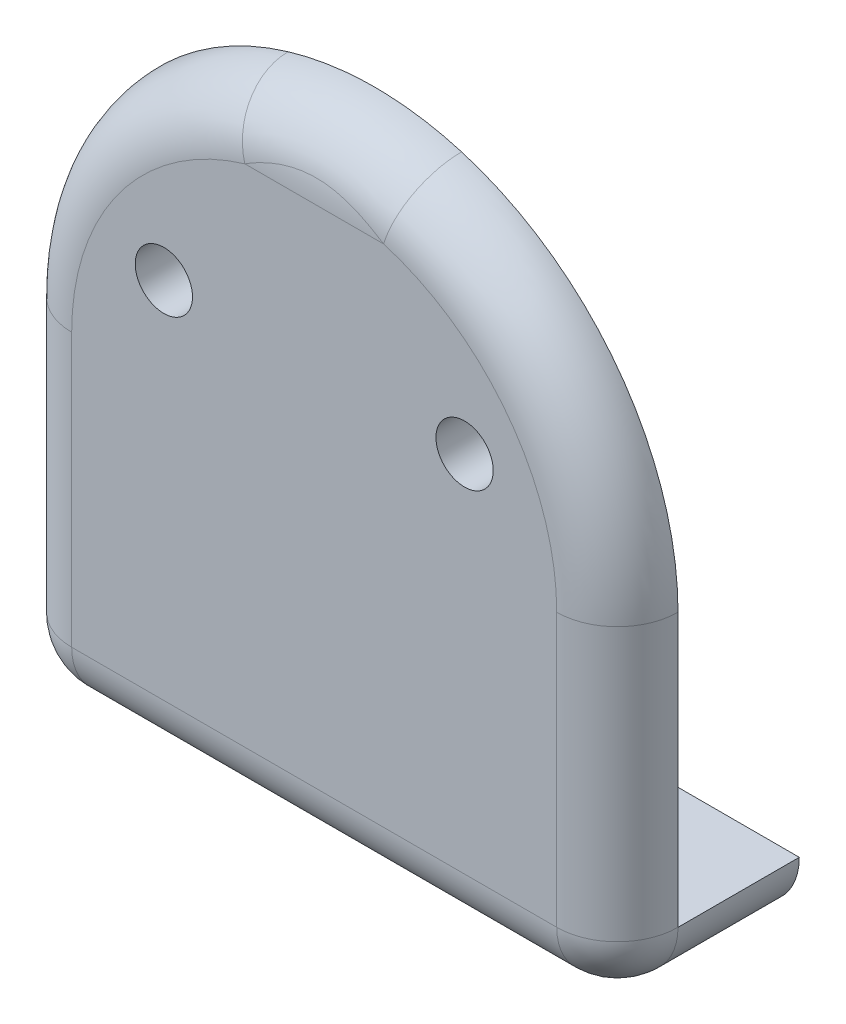
ISO-10303-21;
HEADER;
FILE_DESCRIPTION(('STEP AP214'),'2;1');
FILE_NAME('part.step','',(''),(''),'','','');
FILE_SCHEMA(('AUTOMOTIVE_DESIGN { 1 0 10303 214 1 1 1 1 }'));
ENDSEC;
DATA;
#1=APPLICATION_CONTEXT('core data for automotive mechanical design processes');
#2=APPLICATION_PROTOCOL_DEFINITION('international standard','automotive_design',2000,#1);
#3=PRODUCT_CONTEXT('',#1,'mechanical');
#4=PRODUCT('Part','Part','',(#3));
#5=PRODUCT_RELATED_PRODUCT_CATEGORY('part','',(#4));
#6=PRODUCT_DEFINITION_FORMATION('','',#4);
#7=PRODUCT_DEFINITION_CONTEXT('part definition',#1,'design');
#8=PRODUCT_DEFINITION('design','',#6,#7);
#9=PRODUCT_DEFINITION_SHAPE('','',#8);
#10=(LENGTH_UNIT() NAMED_UNIT(*) SI_UNIT(.MILLI.,.METRE.));
#11=(NAMED_UNIT(*) PLANE_ANGLE_UNIT() SI_UNIT($,.RADIAN.));
#12=(NAMED_UNIT(*) SI_UNIT($,.STERADIAN.) SOLID_ANGLE_UNIT());
#13=UNCERTAINTY_MEASURE_WITH_UNIT(LENGTH_MEASURE(1.E-05),#10,'distance_accuracy_value','');
#14=(GEOMETRIC_REPRESENTATION_CONTEXT(3) GLOBAL_UNCERTAINTY_ASSIGNED_CONTEXT((#13)) GLOBAL_UNIT_ASSIGNED_CONTEXT((#10,
#11,#12)) REPRESENTATION_CONTEXT('',''));
#15=CARTESIAN_POINT('',(0.,0.,0.));
#16=DIRECTION('',(0.,0.,1.));
#17=DIRECTION('',(1.,0.,0.));
#18=AXIS2_PLACEMENT_3D('',#15,#16,#17);
#19=CARTESIAN_POINT('',(31.75,-3.175,3.175));
#20=DIRECTION('',(0.,1.,0.));
#21=DIRECTION('',(0.,0.,1.));
#22=AXIS2_PLACEMENT_3D('',#19,#20,#21);
#23=PLANE('',#22);
#24=DIRECTION('',(0.,0.,-1.));
#25=VECTOR('',#24,1.);
#26=CARTESIAN_POINT('',(3.175,-3.175,3.175));
#27=LINE('',#26,#25);
#28=CARTESIAN_POINT('',(3.175,-3.175,0.));
#29=VERTEX_POINT('',#28);
#30=CARTESIAN_POINT('',(3.175,-3.175,-6.35));
#31=VERTEX_POINT('',#30);
#32=EDGE_CURVE('E127',#29,#31,#27,.T.);
#33=ORIENTED_EDGE('',*,*,#32,.T.);
#34=DIRECTION('',(-1.,0.,0.));
#35=VECTOR('',#34,1.);
#36=CARTESIAN_POINT('',(0.,-3.175,-6.35));
#37=LINE('',#36,#35);
#38=CARTESIAN_POINT('',(28.575,-3.175,-6.35));
#39=VERTEX_POINT('',#38);
#40=EDGE_CURVE('E57',#39,#31,#37,.T.);
#41=ORIENTED_EDGE('',*,*,#40,.F.);
#42=DIRECTION('',(0.,0.,-1.));
#43=VECTOR('',#42,1.);
#44=CARTESIAN_POINT('',(28.575,-3.175,0.));
#45=LINE('',#44,#43);
#46=CARTESIAN_POINT('',(28.575,-3.175,0.));
#47=VERTEX_POINT('',#46);
#48=EDGE_CURVE('E124',#39,#47,#45,.F.);
#49=ORIENTED_EDGE('',*,*,#48,.T.);
#50=DIRECTION('',(-1.,0.,0.));
#51=VECTOR('',#50,1.);
#52=CARTESIAN_POINT('',(31.75,-3.175,0.));
#53=LINE('',#52,#51);
#54=EDGE_CURVE('E311',#47,#29,#53,.T.);
#55=ORIENTED_EDGE('',*,*,#54,.T.);
#56=EDGE_LOOP('',(#33,#41,#49,#55));
#57=FACE_BOUND('',#56,.T.);
#58=ADVANCED_FACE('F42',(#57),#23,.F.);
#59=CARTESIAN_POINT('',(31.75,0.,-31.75));
#60=DIRECTION('',(0.,-1.,0.));
#61=DIRECTION('',(0.,0.,-1.));
#62=AXIS2_PLACEMENT_3D('',#59,#60,#61);
#63=PLANE('',#62);
#64=DIRECTION('',(0.,0.,1.));
#65=VECTOR('',#64,1.);
#66=CARTESIAN_POINT('',(31.75,0.,-31.75));
#67=LINE('',#66,#65);
#68=CARTESIAN_POINT('',(31.75,0.,-6.35));
#69=VERTEX_POINT('',#68);
#70=CARTESIAN_POINT('',(31.75,0.,0.));
#71=VERTEX_POINT('',#70);
#72=EDGE_CURVE('E290',#69,#71,#67,.T.);
#73=ORIENTED_EDGE('',*,*,#72,.F.);
#74=DIRECTION('',(-1.,0.,0.));
#75=VECTOR('',#74,1.);
#76=CARTESIAN_POINT('',(31.75,0.,-6.35));
#77=LINE('',#76,#75);
#78=CARTESIAN_POINT('',(0.,0.,-6.35));
#79=VERTEX_POINT('',#78);
#80=EDGE_CURVE('E114',#69,#79,#77,.T.);
#81=ORIENTED_EDGE('',*,*,#80,.T.);
#82=DIRECTION('',(0.,0.,1.));
#83=VECTOR('',#82,1.);
#84=CARTESIAN_POINT('',(0.,0.,-31.75));
#85=LINE('',#84,#83);
#86=CARTESIAN_POINT('',(0.,0.,0.));
#87=VERTEX_POINT('',#86);
#88=EDGE_CURVE('E298',#79,#87,#85,.T.);
#89=ORIENTED_EDGE('',*,*,#88,.T.);
#90=DIRECTION('',(-1.,0.,0.));
#91=VECTOR('',#90,1.);
#92=CARTESIAN_POINT('',(31.75,0.,0.));
#93=LINE('',#92,#91);
#94=EDGE_CURVE('E297',#71,#87,#93,.T.);
#95=ORIENTED_EDGE('',*,*,#94,.F.);
#96=EDGE_LOOP('',(#73,#81,#89,#95));
#97=FACE_BOUND('',#96,.T.);
#98=ADVANCED_FACE('F190',(#97),#63,.F.);
#99=CARTESIAN_POINT('',(31.75,31.75,3.175));
#100=DIRECTION('',(0.,0.,-1.));
#101=DIRECTION('',(0.,1.,0.));
#102=AXIS2_PLACEMENT_3D('',#99,#100,#101);
#103=PLANE('',#102);
#104=CARTESIAN_POINT('',(23.749,19.05,3.175));
#105=DIRECTION('',(0.,0.,1.));
#106=DIRECTION('',(1.,0.,0.));
#107=AXIS2_PLACEMENT_3D('',#104,#105,#106);
#108=CIRCLE('',#107,1.5);
#109=CARTESIAN_POINT('',(25.249,19.05,3.175));
#110=VERTEX_POINT('',#109);
#111=EDGE_CURVE('E274',#110,#110,#108,.T.);
#112=ORIENTED_EDGE('',*,*,#111,.F.);
#113=EDGE_LOOP('',(#112));
#114=FACE_BOUND('',#113,.T.);
#115=CARTESIAN_POINT('',(8.001,19.05,3.175));
#116=DIRECTION('',(0.,0.,1.));
#117=DIRECTION('',(1.,0.,0.));
#118=AXIS2_PLACEMENT_3D('',#115,#116,#117);
#119=CIRCLE('',#118,1.5);
#120=CARTESIAN_POINT('',(9.501,19.05,3.175));
#121=VERTEX_POINT('',#120);
#122=EDGE_CURVE('E277',#121,#121,#119,.T.);
#123=ORIENTED_EDGE('',*,*,#122,.F.);
#124=EDGE_LOOP('',(#123));
#125=FACE_BOUND('',#124,.T.);
#126=CARTESIAN_POINT('',(15.875,14.2875,3.175));
#127=DIRECTION('',(0.,0.,-1.));
#128=DIRECTION('',(0.,1.,0.));
#129=AXIS2_PLACEMENT_3D('',#126,#127,#128);
#130=CIRCLE('',#129,12.7);
#131=CARTESIAN_POINT('',(12.2416301794497,26.4566669290512,3.175));
#132=VERTEX_POINT('',#131);
#133=CARTESIAN_POINT('',(3.17500000000001,14.2875,3.175));
#134=VERTEX_POINT('',#133);
#135=EDGE_CURVE('E153',#132,#134,#130,.F.);
#136=ORIENTED_EDGE('',*,*,#135,.T.);
#137=DIRECTION('',(0.,-1.,0.));
#138=VECTOR('',#137,1.);
#139=CARTESIAN_POINT('',(3.175,31.75,3.175));
#140=LINE('',#139,#138);
#141=CARTESIAN_POINT('',(3.175,0.,3.175));
#142=VERTEX_POINT('',#141);
#143=EDGE_CURVE('E156',#134,#142,#140,.T.);
#144=ORIENTED_EDGE('',*,*,#143,.T.);
#145=DIRECTION('',(-1.,0.,0.));
#146=VECTOR('',#145,1.);
#147=CARTESIAN_POINT('',(31.75,0.,3.175));
#148=LINE('',#147,#146);
#149=CARTESIAN_POINT('',(28.575,0.,3.175));
#150=VERTEX_POINT('',#149);
#151=EDGE_CURVE('E141',#142,#150,#148,.F.);
#152=ORIENTED_EDGE('',*,*,#151,.T.);
#153=DIRECTION('',(0.,-1.,0.));
#154=VECTOR('',#153,1.);
#155=CARTESIAN_POINT('',(28.575,14.2875,3.175));
#156=LINE('',#155,#154);
#157=CARTESIAN_POINT('',(28.575,14.2875,3.175));
#158=VERTEX_POINT('',#157);
#159=EDGE_CURVE('E147',#150,#158,#156,.F.);
#160=ORIENTED_EDGE('',*,*,#159,.T.);
#161=CARTESIAN_POINT('',(15.875,14.2875,3.175));
#162=DIRECTION('',(0.,0.,-1.));
#163=DIRECTION('',(0.,1.,0.));
#164=AXIS2_PLACEMENT_3D('',#161,#162,#163);
#165=CIRCLE('',#164,12.7);
#166=CARTESIAN_POINT('',(19.5083698205503,26.4566669290512,3.175));
#167=VERTEX_POINT('',#166);
#168=EDGE_CURVE('E150',#158,#167,#165,.F.);
#169=ORIENTED_EDGE('',*,*,#168,.T.);
#170=DIRECTION('',(-1.,0.,0.));
#171=VECTOR('',#170,1.);
#172=CARTESIAN_POINT('',(31.75,26.4566669290512,3.175));
#173=LINE('',#172,#171);
#174=EDGE_CURVE('E307',#167,#132,#173,.T.);
#175=ORIENTED_EDGE('',*,*,#174,.T.);
#176=EDGE_LOOP('',(#136,#144,#152,#160,#169,#175));
#177=FACE_BOUND('',#176,.T.);
#178=ADVANCED_FACE('F186',(#114,#125,#177),#103,.F.);
#179=CARTESIAN_POINT('',(31.75,0.,0.));
#180=DIRECTION('',(0.,0.,1.));
#181=DIRECTION('',(1.,0.,0.));
#182=AXIS2_PLACEMENT_3D('',#179,#180,#181);
#183=PLANE('',#182);
#184=CARTESIAN_POINT('',(23.749,19.05,0.));
#185=DIRECTION('',(0.,0.,1.));
#186=DIRECTION('',(1.,0.,0.));
#187=AXIS2_PLACEMENT_3D('',#184,#185,#186);
#188=CIRCLE('',#187,1.5);
#189=CARTESIAN_POINT('',(25.249,19.05,0.));
#190=VERTEX_POINT('',#189);
#191=EDGE_CURVE('E301',#190,#190,#188,.T.);
#192=ORIENTED_EDGE('',*,*,#191,.T.);
#193=EDGE_LOOP('',(#192));
#194=FACE_BOUND('',#193,.T.);
#195=CARTESIAN_POINT('',(8.001,19.05,0.));
#196=DIRECTION('',(0.,0.,1.));
#197=DIRECTION('',(1.,0.,0.));
#198=AXIS2_PLACEMENT_3D('',#195,#196,#197);
#199=CIRCLE('',#198,1.5);
#200=CARTESIAN_POINT('',(9.501,19.05,0.));
#201=VERTEX_POINT('',#200);
#202=EDGE_CURVE('E289',#201,#201,#199,.T.);
#203=ORIENTED_EDGE('',*,*,#202,.T.);
#204=EDGE_LOOP('',(#203));
#205=FACE_BOUND('',#204,.T.);
#206=CARTESIAN_POINT('',(15.875,14.2875,0.));
#207=DIRECTION('',(0.,0.,1.));
#208=DIRECTION('',(1.,0.,0.));
#209=AXIS2_PLACEMENT_3D('',#206,#207,#208);
#210=CIRCLE('',#209,15.875);
#211=CARTESIAN_POINT('',(0.,14.2875,0.));
#212=VERTEX_POINT('',#211);
#213=CARTESIAN_POINT('',(11.3332877243121,29.498958661314,0.));
#214=VERTEX_POINT('',#213);
#215=EDGE_CURVE('E286',#212,#214,#210,.F.);
#216=ORIENTED_EDGE('',*,*,#215,.T.);
#217=CARTESIAN_POINT('',(23.6865762066118,28.1075905267765,-0.228532088185216));
#218=CARTESIAN_POINT('',(24.5022616638408,27.6465378949269,4.213191673292));
#219=CARTESIAN_POINT('',(22.1242609652894,24.0925723995715,2.68962211358892));
#220=CARTESIAN_POINT('',(23.5591611280114,28.1796186254902,-0.203848311067905));
#221=CARTESIAN_POINT('',(24.3061607755895,27.7671784497967,4.17260446158139));
#222=CARTESIAN_POINT('',(22.022328902192,24.2149564246089,2.74204783544834));
#223=CARTESIAN_POINT('',(23.4301530783701,28.2502046398263,-0.181891344310459));
#224=CARTESIAN_POINT('',(24.1127854432626,27.8815058321529,4.129291126789));
#225=CARTESIAN_POINT('',(21.9191224625644,24.3348901839097,2.78868210091925));
#226=CARTESIAN_POINT('',(23.1693989938212,28.3881754724301,-0.142758541862929));
#227=CARTESIAN_POINT('',(23.7355266488468,28.0959350323296,4.04022541489352));
#228=CARTESIAN_POINT('',(21.7105191951971,24.5693185026222,2.87179601694173));
#229=CARTESIAN_POINT('',(23.0376543257494,28.4555618360462,-0.125580378248716));
#230=CARTESIAN_POINT('',(23.5512384095479,28.1964649239591,3.99448241221739));
#231=CARTESIAN_POINT('',(21.605123460926,24.6838156877585,2.90828061175706));
#232=CARTESIAN_POINT('',(22.7720622568397,28.5867329010038,-0.0953454970632279));
#233=CARTESIAN_POINT('',(23.1908949520385,28.3852072332956,3.90245148008315));
#234=CARTESIAN_POINT('',(21.3926498057684,24.9066904174526,2.97249628865416));
#235=CARTESIAN_POINT('',(22.638220524237,28.6505256932094,-0.0822791900684128));
#236=CARTESIAN_POINT('',(23.0144776534859,28.4737891947401,3.85613057348334));
#237=CARTESIAN_POINT('',(21.285576419471,25.0150817093241,3.00024773765085));
#238=CARTESIAN_POINT('',(22.3684128794677,28.7745032634739,-0.0596218456647169));
#239=CARTESIAN_POINT('',(22.6681012709956,28.6405697002598,3.76396110268417));
#240=CARTESIAN_POINT('',(21.069730303493,25.2257338632853,3.04836953156924));
#241=CARTESIAN_POINT('',(22.2324466823865,28.8346875522648,-0.0500312786374647));
#242=CARTESIAN_POINT('',(22.497831188444,28.7190520576185,3.71805275167324));
#243=CARTESIAN_POINT('',(20.9609573458809,25.3279938940525,3.06873887745024));
#244=CARTESIAN_POINT('',(21.8223092472363,29.0093641156572,-0.0256843465582058));
#245=CARTESIAN_POINT('',(21.9999868735882,28.9387612748946,3.58362608086235));
#246=CARTESIAN_POINT('',(20.6328473978456,25.6247894712516,3.12044917501238));
#247=CARTESIAN_POINT('',(21.5453271839387,29.1182627718299,-0.0152927178401524));
#248=CARTESIAN_POINT('',(21.674433072997,29.0697937751897,3.4954650928912));
#249=CARTESIAN_POINT('',(20.411261747167,25.809820816158,3.14251988962805));
#250=CARTESIAN_POINT('',(20.985262954825,29.3204506009369,-0.00244608330806108));
#251=CARTESIAN_POINT('',(21.0387303209768,29.3029593849936,3.32860964022392));
#252=CARTESIAN_POINT('',(19.9632103638461,26.153361198211,3.16980477715233));
#253=CARTESIAN_POINT('',(20.7021759673523,29.4137268846086,2.39929505153361E-06));
#254=CARTESIAN_POINT('',(20.7267653467273,29.4063865547839,3.24929203441845));
#255=CARTESIAN_POINT('',(19.7367407738786,26.3118483350177,3.17500509545575));
#256=CARTESIAN_POINT('',(20.2040889582634,29.5624422623543,-1.78707866691882E-06));
#257=CARTESIAN_POINT('',(20.1903937550443,29.5665302616614,3.12077166009412));
#258=CARTESIAN_POINT('',(19.3382711666131,26.5645328706308,3.17499620472678));
#259=CARTESIAN_POINT('',(19.9901470952319,29.6214629397549,-0.00136327199923371));
#260=CARTESIAN_POINT('',(19.9643725136759,29.6285368456966,3.0690466816549));
#261=CARTESIAN_POINT('',(19.1671176761862,26.6648157915335,3.1721045551429));
#262=CARTESIAN_POINT('',(19.5599844513108,29.7304837550772,-0.00573991424078307));
#263=CARTESIAN_POINT('',(19.5166983022909,29.7409204110836,2.9726732731676));
#264=CARTESIAN_POINT('',(18.822987561048,26.8500546989858,3.16280903159192));
#265=CARTESIAN_POINT('',(19.343763496011,29.7804831972555,-0.00875519903514956));
#266=CARTESIAN_POINT('',(19.2944532685707,29.7915951950214,2.9278104838221));
#267=CARTESIAN_POINT('',(18.6500107968087,26.9350095033873,3.1564048868849));
#268=CARTESIAN_POINT('',(18.9094216094518,29.8713744863091,-0.0155171427988983));
#269=CARTESIAN_POINT('',(18.8532518089277,29.8823446796167,2.84571032714409));
#270=CARTESIAN_POINT('',(18.3025372875617,27.0894442600055,3.14204323644005));
#271=CARTESIAN_POINT('',(18.6913005552342,29.9122657391616,-0.019263849440657));
#272=CARTESIAN_POINT('',(18.6337398068259,29.9226487560475,2.80828822981219));
#273=CARTESIAN_POINT('',(18.1280404441875,27.1589232029092,3.13408562945117));
#274=CARTESIAN_POINT('',(18.2535351502703,29.9848699158799,-0.0267197256774117));
#275=CARTESIAN_POINT('',(18.1971801239324,29.9933877639414,2.74152391339329));
#276=CARTESIAN_POINT('',(17.7778281202161,27.2822860518524,3.11825014014791));
#277=CARTESIAN_POINT('',(18.0338908019531,30.0165828543792,-0.0304288953322458));
#278=CARTESIAN_POINT('',(17.9796019367916,30.0239956891781,2.71202976850773));
#279=CARTESIAN_POINT('',(17.6021126415625,27.3361699827558,3.11037225770646));
#280=CARTESIAN_POINT('',(17.5932669295329,30.0707980134328,-0.0372002572054407));
#281=CARTESIAN_POINT('',(17.5460781379344,30.0758755722106,2.66146464075053));
#282=CARTESIAN_POINT('',(17.2496135436263,27.4282877751281,3.09599060416023));
#283=CARTESIAN_POINT('',(17.3722864494685,30.0932925760386,-0.0402619104973527));
#284=CARTESIAN_POINT('',(17.3296176868885,30.0972637536623,2.6402844197824));
#285=CARTESIAN_POINT('',(17.0728291595748,27.4665086248616,3.08948797767798));
#286=CARTESIAN_POINT('',(16.9295825727842,30.128989526756,-0.0452888115662118));
#287=CARTESIAN_POINT('',(16.8980157141126,30.131006678995,2.60664719837509));
#288=CARTESIAN_POINT('',(16.7186660582273,27.5271618508601,3.07881137364157));
#289=CARTESIAN_POINT('',(16.7078592668489,30.1421930103718,-0.0472541885986029));
#290=CARTESIAN_POINT('',(16.6823691182568,30.1434416469685,2.59411151117151));
#291=CARTESIAN_POINT('',(16.5412874134792,27.5495960885126,3.07463712156258));
#292=CARTESIAN_POINT('',(16.2640755078161,30.1592845030355,-0.0498215610503361));
#293=CARTESIAN_POINT('',(16.2519676712202,30.1594845078264,2.5779081057532));
#294=CARTESIAN_POINT('',(16.1862604062529,27.5786365008252,3.06918429511224));
#295=CARTESIAN_POINT('',(16.0420151157926,30.163174035341,-0.0504237794076794));
#296=CARTESIAN_POINT('',(16.0367132946178,30.1631311160314,2.57420139319749));
#297=CARTESIAN_POINT('',(16.0086120926341,27.5852452636753,3.06790524724426));
#298=CARTESIAN_POINT('',(15.5979460999142,30.1616352785011,-0.050189867784945));
#299=CARTESIAN_POINT('',(15.606687632323,30.1616901239029,2.57566046873514));
#300=CARTESIAN_POINT('',(15.6533568799314,27.5826307387786,3.06840205068987));
#301=CARTESIAN_POINT('',(15.3759374739974,30.1562074643541,-0.0493538111281515));
#302=CARTESIAN_POINT('',(15.3914185116813,30.1565996305443,2.58082919018075));
#303=CARTESIAN_POINT('',(15.4757499791979,27.5734082581089,3.07017774627258));
#304=CARTESIAN_POINT('',(14.8304246866198,30.1314094770452,-0.0456483682004696));
#305=CARTESIAN_POINT('',(14.861732532741,30.1332886716986,2.60434754718241));
#306=CARTESIAN_POINT('',(15.0393397492959,27.531273624809,3.07804771356223));
#307=CARTESIAN_POINT('',(14.5071533372236,30.106779251966,-0.0420212532158472));
#308=CARTESIAN_POINT('',(14.5463373259389,30.1100079909096,2.62776471788648));
#309=CARTESIAN_POINT('',(14.7807226697789,27.4894240388284,3.08575132056261));
#310=CARTESIAN_POINT('',(13.8628272998814,30.0377942184425,-0.0329437695737465));
#311=CARTESIAN_POINT('',(13.9148694650632,30.0443410872162,2.69237922284319));
#312=CARTESIAN_POINT('',(14.265261839905,27.3722105305406,3.10503093188064));
#313=CARTESIAN_POINT('',(13.5417723090511,29.9934421616029,-0.027493655288757));
#314=CARTESIAN_POINT('',(13.5972090691913,30.001625848964,2.73389152366836));
#315=CARTESIAN_POINT('',(14.0084178472405,27.2968512835261,3.11660639593812));
#316=CARTESIAN_POINT('',(12.9034954592995,29.8852687402877,-0.0166175020053736));
#317=CARTESIAN_POINT('',(12.9598230846672,29.8960414428496,2.83322896073894));
#318=CARTESIAN_POINT('',(13.4977963674399,27.1130521959781,3.13970619033999));
#319=CARTESIAN_POINT('',(12.5862682070319,29.8214792170256,-0.0111914382484028));
#320=CARTESIAN_POINT('',(12.6384434041632,29.8326533613292,2.89150956642688));
#321=CARTESIAN_POINT('',(13.2440145656267,27.0046664573296,3.15123057326956));
#322=CARTESIAN_POINT('',(11.9561794812049,29.6746088891705,-0.00288196887965727));
#323=CARTESIAN_POINT('',(11.9904255311975,29.6835983147069,3.0227010938611));
#324=CARTESIAN_POINT('',(12.7399435849627,26.7551168737062,3.16887900406048));
#325=CARTESIAN_POINT('',(11.6433187952957,29.59152465064,9.83688320373468E-07));
#326=CARTESIAN_POINT('',(11.66200724304,29.5971037721886,3.09624161151277));
#327=CARTESIAN_POINT('',(12.4896550362321,26.6139471940762,3.17500208970506));
#328=CARTESIAN_POINT('',(11.0482734797273,29.4138619468516,-9.04313180587171E-07));
#329=CARTESIAN_POINT('',(11.0237237461253,29.4065327807959,3.2491688846164));
#330=CARTESIAN_POINT('',(12.0136187837859,26.3120778213144,3.17499807891606));
#331=CARTESIAN_POINT('',(10.7656506230477,29.3207519356091,-0.0024391050303012));
#332=CARTESIAN_POINT('',(10.7122880732133,29.3032971787165,3.32834893889028));
#333=CARTESIAN_POINT('',(11.7875204984528,26.1538732004875,3.16981959825298));
#334=CARTESIAN_POINT('',(10.2064298824745,29.1189253854856,-0.0152384975091423));
#335=CARTESIAN_POINT('',(10.0776105996915,29.0705799440541,3.4949220158111));
#336=CARTESIAN_POINT('',(11.3401439059623,25.810946672991,3.14263504785276));
#337=CARTESIAN_POINT('',(9.92982827641929,29.0102188227834,-0.0255946428283822));
#338=CARTESIAN_POINT('',(9.75256000249388,28.9398062525598,3.58293650143103));
#339=CARTESIAN_POINT('',(11.1188626210757,25.6262417169971,3.12063969622194));
#340=CARTESIAN_POINT('',(9.51982710390156,28.8356835690101,-0.0498779208412001));
#341=CARTESIAN_POINT('',(9.25499301842744,28.7203386101207,3.71729095822925));
#342=CARTESIAN_POINT('',(10.7908616831513,25.3296862410837,3.06906459311763));
#343=CARTESIAN_POINT('',(9.38363109900351,28.7754217421296,-0.059466753534183));
#344=CARTESIAN_POINT('',(9.08447806700161,28.6417796836048,3.76326922052929));
#345=CARTESIAN_POINT('',(10.6819048792886,25.2272944641725,3.04869893076419));
#346=CARTESIAN_POINT('',(9.11336878816418,28.6512764403179,-0.0821293883312051));
#347=CARTESIAN_POINT('',(8.73759769173503,28.4748206174797,3.85558390969851));
#348=CARTESIAN_POINT('',(10.4656950304452,25.0163573150451,3.00056590065214));
#349=CARTESIAN_POINT('',(8.97930220275546,28.5873934457455,-0.095202729052491));
#350=CARTESIAN_POINT('',(8.56091990514921,28.3861354997576,3.90198049105301));
#351=CARTESIAN_POINT('',(10.3584417618905,24.9078127590138,2.97279951282156));
#352=CARTESIAN_POINT('',(8.71329116305689,28.4560420353177,-0.125460246944511));
#353=CARTESIAN_POINT('',(8.20007020270683,28.1971730087018,3.99415588386369));
#354=CARTESIAN_POINT('',(10.1456329301002,24.684631601623,2.90853575797115));
#355=CARTESIAN_POINT('',(8.58135194985173,28.3885661341012,-0.142653290196353));
#356=CARTESIAN_POINT('',(8.01553538367464,28.0965264337702,4.03996823222099));
#357=CARTESIAN_POINT('',(10.0400815597333,24.5699822817692,2.8720195603385));
#358=CARTESIAN_POINT('',(8.32021637435457,28.2504067998756,-0.18182851393193));
#359=CARTESIAN_POINT('',(7.63776180652217,27.8818293456041,4.12916831368742));
#360=CARTESIAN_POINT('',(9.83117309962317,24.3352336770668,2.78881554593671));
#361=CARTESIAN_POINT('',(8.19102137741397,28.1797218226718,-0.203813019807463));
#362=CARTESIAN_POINT('',(7.44411661589065,27.7673490633455,4.17254671858845));
#363=CARTESIAN_POINT('',(9.72781710216107,24.2151317684537,2.74212279028222));
#364=CARTESIAN_POINT('',(8.06342379338824,28.1075905267765,-0.228532088185215));
#365=CARTESIAN_POINT('',(7.24773833615923,27.6465378949269,4.213191673292));
#366=CARTESIAN_POINT('',(9.62573903471059,24.0925723995715,2.68962211358892));
#367=(BOUNDED_SURFACE() B_SPLINE_SURFACE(3,2,((#217,#218,#219),(#220,#221,#222),(#223,#224,
#225),(#226,#227,#228),(#229,#230,#231),(#232,#233,#234),(#235,#236,#237),(#238,#239,#240),
(#241,#242,#243),(#244,#245,#246),(#247,#248,#249),(#250,#251,#252),(#253,#254,#255),(#256,#257,
#258),(#259,#260,#261),(#262,#263,#264),(#265,#266,#267),(#268,#269,#270),(#271,#272,#273),
(#274,#275,#276),(#277,#278,#279),(#280,#281,#282),(#283,#284,#285),(#286,#287,#288),(#289,#290,
#291),(#292,#293,#294),(#295,#296,#297),(#298,#299,#300),(#301,#302,#303),(#304,#305,#306),
(#307,#308,#309),(#310,#311,#312),(#313,#314,#315),(#316,#317,#318),(#319,#320,#321),(#322,#323,
#324),(#325,#326,#327),(#328,#329,#330),(#331,#332,#333),(#334,#335,#336),(#337,#338,#339),
(#340,#341,#342),(#343,#344,#345),(#346,#347,#348),(#349,#350,#351),(#352,#353,#354),(#355,#356,
#357),(#358,#359,#360),(#361,#362,#363),(#364,#365,#366)),.UNSPECIFIED.,.F.,.F.,
.F.) B_SPLINE_SURFACE_WITH_KNOTS((4,2,2,2,2,2,2,2,2,2,2,2,2,2,2,2,2,2,2,2,2,2,2,2,4),(3,3),(0.,
0.358905450047362,0.71763575716925,1.07552314645894,1.43345895158146,2.14779287513662,
2.86271328832032,3.39521095574466,3.92774967337222,4.46032311223157,4.99289570197693,
5.52590982135737,6.05886108290741,6.59172517655964,7.12456210559652,7.90221189644887,
8.679753223052,9.45602761702081,10.2324402728628,10.9462031414968,11.6595114775558,
12.0180248479279,12.376490771205,12.735735195719,13.0951543584571),(0.,1.),
.UNSPECIFIED.) GEOMETRIC_REPRESENTATION_ITEM() RATIONAL_B_SPLINE_SURFACE(((1.,0.573143469090705,
1.),(1.,0.580109085018388,1.),(1.,0.586929468009645,1.),(1.,0.600251396999919,1.),(1.,
0.606753096964603,1.),(1.,0.619401258715217,1.),(1.,0.625548519316178,1.),(1.,0.637489043432527,
1.),(1.,0.643282258945868,1.),(1.,0.660088633748457,1.),(1.,0.670555764714566,1.),(1.,
0.689977050619878,1.),(1.,0.698929956304483,1.),(1.,0.713197165649409,1.),(1.,0.718856996770169,
1.),(1.,0.729308574437833,1.),(1.,0.734100254030532,1.),(1.,0.7428088315485,1.),(1.,
0.746725672418115,1.),(1.,0.753679033158105,1.),(1.,0.756715554432018,1.),(1.,0.761906077410493,
1.),(1.,0.764059345374582,1.),(1.,0.7674761745705,1.),(1.,0.768739840694622,1.),(1.,
0.770375586463278,1.),(1.,0.770747811899198,1.),(1.,0.770600548243132,1.),(1.,0.770081104608453,
1.),(1.,0.767707781833751,1.),(1.,0.765350446388883,1.),(1.,0.758746502268623,1.),(1.,
0.754500157149225,1.),(1.,0.744139966187064,1.),(1.,0.738029174540236,1.),(1.,0.723952974584584,
1.),(1.,0.715987236144698,1.),(1.,0.698942902148756,1.),(1.,0.69000597021296,1.),(1.,
0.670619437769291,1.),(1.,0.660170804170712,1.),(1.,0.643378121717333,1.),(1.,0.637577474429296,
1.),(1.,0.625620854391658,1.),(1.,0.61946492876885,1.),(1.,0.606799422992079,1.),(1.,
0.600289103820683,1.),(1.,0.586949001585429,1.),(1.,0.580119064673064,1.),(1.,0.573143469090705,1.))) REPRESENTATION_ITEM('') SURFACE());
#368=CARTESIAN_POINT('',(11.3332877243121,29.498958661314,0.));
#369=CARTESIAN_POINT('',(11.5495265472812,29.5635196886766,0.));
#370=CARTESIAN_POINT('',(11.7671142375509,29.6234637299378,0.));
#371=CARTESIAN_POINT('',(12.204646236629,29.7340173189985,0.));
#372=CARTESIAN_POINT('',(12.424590526421,29.7846269420619,0.));
#373=CARTESIAN_POINT('',(13.08740235011,29.9222945647902,0.));
#374=CARTESIAN_POINT('',(13.5332974795623,29.995205839667,0.));
#375=CARTESIAN_POINT('',(14.4189478998818,30.1014689599075,0.));
#376=CARTESIAN_POINT('',(14.8585973497378,30.1357195737856,0.));
#377=CARTESIAN_POINT('',(15.7391615413969,30.1676172627662,0.));
#378=CARTESIAN_POINT('',(16.1800759413731,30.1652734379592,0.));
#379=CARTESIAN_POINT('',(16.9386610543905,30.1297127694093,0.));
#380=CARTESIAN_POINT('',(17.2567692443713,30.1051929274646,0.));
#381=CARTESIAN_POINT('',(17.8909291688652,30.0370405601386,0.));
#382=CARTESIAN_POINT('',(18.206981032719,29.9934092488763,0.));
#383=CARTESIAN_POINT('',(18.8413960541876,29.8862223073977,0.));
#384=CARTESIAN_POINT('',(19.1597023423971,29.8223302600258,0.));
#385=CARTESIAN_POINT('',(19.7918621919136,29.6751364912864,0.));
#386=CARTESIAN_POINT('',(20.1057148485759,29.5918308847538,0.));
#387=CARTESIAN_POINT('',(20.4167122756879,29.498958661314,0.));
#388=B_SPLINE_CURVE_WITH_KNOTS('',3,(#368,#369,#370,#371,#372,#373,#374,#375,#376,#377,#378,
#379,#380,#381,#382,#383,#384,#385,#386,#387),.UNSPECIFIED.,.F.,.F.,(4,2,2,2,2,2,2,2,2,4),(0.,
0.676904526030722,1.35380359391709,2.70744994185857,4.02893374163142,5.35008892779419,
6.30670774245735,7.26326579357689,8.2366210033838,9.21017117477251),.UNSPECIFIED.);
#389=CARTESIAN_POINT('',(20.4167122756879,29.498958661314,0.));
#390=VERTEX_POINT('',#389);
#391=EDGE_CURVE('E65',#214,#390,#388,.T.);
#392=ORIENTED_EDGE('',*,*,#391,.T.);
#393=CARTESIAN_POINT('',(31.75,14.2875,0.));
#394=VERTEX_POINT('',#393);
#395=EDGE_CURVE('E270',#390,#394,#210,.F.);
#396=ORIENTED_EDGE('',*,*,#395,.T.);
#397=DIRECTION('',(0.,1.,0.));
#398=VECTOR('',#397,1.);
#399=CARTESIAN_POINT('',(31.75,0.,0.));
#400=LINE('',#399,#398);
#401=EDGE_CURVE('E293',#71,#394,#400,.T.);
#402=ORIENTED_EDGE('',*,*,#401,.F.);
#403=ORIENTED_EDGE('',*,*,#94,.T.);
#404=DIRECTION('',(0.,1.,0.));
#405=VECTOR('',#404,1.);
#406=CARTESIAN_POINT('',(0.,0.,0.));
#407=LINE('',#406,#405);
#408=EDGE_CURVE('E294',#87,#212,#407,.T.);
#409=ORIENTED_EDGE('',*,*,#408,.T.);
#410=EDGE_LOOP('',(#216,#392,#396,#402,#403,#409));
#411=FACE_BOUND('',#410,.T.);
#412=ADVANCED_FACE('F180',(#194,#205,#411),#183,.F.);
#413=CARTESIAN_POINT('',(31.75,26.4566669290512,-2.825));
#414=DIRECTION('',(-1.,0.,0.));
#415=DIRECTION('',(0.,0.,1.));
#416=AXIS2_PLACEMENT_3D('',#413,#414,#415);
#417=CYLINDRICAL_SURFACE('',#416,6.);
#418=ORIENTED_EDGE('',*,*,#174,.F.);
#419=CARTESIAN_POINT('',(22.1242609652894,24.0925723995715,2.68962211358892));
#420=CARTESIAN_POINT('',(22.022328902192,24.2149564246089,2.74204783544834));
#421=CARTESIAN_POINT('',(21.9191224625644,24.3348901839097,2.78868210091925));
#422=CARTESIAN_POINT('',(21.7105191951971,24.5693185026222,2.87179601694173));
#423=CARTESIAN_POINT('',(21.605123460926,24.6838156877585,2.90828061175706));
#424=CARTESIAN_POINT('',(21.3926498057684,24.9066904174526,2.97249628865416));
#425=CARTESIAN_POINT('',(21.285576419471,25.0150817093241,3.00024773765085));
#426=CARTESIAN_POINT('',(21.069730303493,25.2257338632853,3.04836953156924));
#427=CARTESIAN_POINT('',(20.9609573458809,25.3279938940525,3.06873887745024));
#428=CARTESIAN_POINT('',(20.6328473978456,25.6247894712516,3.12044917501238));
#429=CARTESIAN_POINT('',(20.411261747167,25.809820816158,3.14251988962805));
#430=CARTESIAN_POINT('',(19.9632103638461,26.153361198211,3.16980477715233));
#431=CARTESIAN_POINT('',(19.7367407738786,26.3118483350177,3.17500509545575));
#432=CARTESIAN_POINT('',(19.3382711666131,26.5645328706308,3.17499620472678));
#433=CARTESIAN_POINT('',(19.1671176761862,26.6648157915335,3.1721045551429));
#434=CARTESIAN_POINT('',(18.822987561048,26.8500546989858,3.16280903159192));
#435=CARTESIAN_POINT('',(18.6500107968087,26.9350095033873,3.1564048868849));
#436=CARTESIAN_POINT('',(18.3025372875617,27.0894442600055,3.14204323644005));
#437=CARTESIAN_POINT('',(18.1280404441875,27.1589232029092,3.13408562945117));
#438=CARTESIAN_POINT('',(17.7778281202161,27.2822860518524,3.11825014014791));
#439=CARTESIAN_POINT('',(17.6021126415625,27.3361699827558,3.11037225770646));
#440=CARTESIAN_POINT('',(17.2496135436263,27.4282877751281,3.09599060416023));
#441=CARTESIAN_POINT('',(17.0728291595748,27.4665086248616,3.08948797767798));
#442=CARTESIAN_POINT('',(16.7186660582273,27.5271618508601,3.07881137364157));
#443=CARTESIAN_POINT('',(16.5412874134792,27.5495960885126,3.07463712156258));
#444=CARTESIAN_POINT('',(16.1862604062529,27.5786365008252,3.06918429511224));
#445=CARTESIAN_POINT('',(16.0086120926341,27.5852452636753,3.06790524724426));
#446=CARTESIAN_POINT('',(15.6533568799314,27.5826307387786,3.06840205068987));
#447=CARTESIAN_POINT('',(15.4757499791979,27.5734082581089,3.07017774627258));
#448=CARTESIAN_POINT('',(15.0393397492959,27.531273624809,3.07804771356223));
#449=CARTESIAN_POINT('',(14.7807226697789,27.4894240388284,3.08575132056261));
#450=CARTESIAN_POINT('',(14.265261839905,27.3722105305406,3.10503093188064));
#451=CARTESIAN_POINT('',(14.0084178472405,27.2968512835261,3.11660639593812));
#452=CARTESIAN_POINT('',(13.4977963674399,27.1130521959781,3.13970619033999));
#453=CARTESIAN_POINT('',(13.2440145656267,27.0046664573296,3.15123057326956));
#454=CARTESIAN_POINT('',(12.7399435849627,26.7551168737062,3.16887900406048));
#455=CARTESIAN_POINT('',(12.4896550362321,26.6139471940762,3.17500208970506));
#456=CARTESIAN_POINT('',(12.0136187837859,26.3120778213144,3.17499807891606));
#457=CARTESIAN_POINT('',(11.7875204984528,26.1538732004875,3.16981959825298));
#458=CARTESIAN_POINT('',(11.3401439059623,25.810946672991,3.14263504785276));
#459=CARTESIAN_POINT('',(11.1188626210757,25.6262417169971,3.12063969622194));
#460=CARTESIAN_POINT('',(10.7908616831513,25.3296862410837,3.06906459311763));
#461=CARTESIAN_POINT('',(10.6819048792886,25.2272944641725,3.04869893076419));
#462=CARTESIAN_POINT('',(10.4656950304452,25.0163573150451,3.00056590065214));
#463=CARTESIAN_POINT('',(10.3584417618905,24.9078127590138,2.97279951282156));
#464=CARTESIAN_POINT('',(10.1456329301002,24.684631601623,2.90853575797115));
#465=CARTESIAN_POINT('',(10.0400815597333,24.5699822817692,2.8720195603385));
#466=CARTESIAN_POINT('',(9.83117309962318,24.3352336770668,2.78881554593671));
#467=CARTESIAN_POINT('',(9.72781710216107,24.2151317684537,2.74212279028222));
#468=CARTESIAN_POINT('',(9.62573903471059,24.0925723995715,2.68962211358892));
#469=B_SPLINE_CURVE_WITH_KNOTS('',3,(#419,#420,#421,#422,#423,#424,#425,#426,#427,#428,#429,
#430,#431,#432,#433,#434,#435,#436,#437,#438,#439,#440,#441,#442,#443,#444,#445,#446,#447,#448,
#449,#450,#451,#452,#453,#454,#455,#456,#457,#458,#459,#460,#461,#462,#463,#464,#465,#466,#467,
#468),.UNSPECIFIED.,.F.,.F.,(4,2,2,2,2,2,2,2,2,2,2,2,2,2,2,2,2,2,2,2,2,2,2,2,4),(0.,
0.358905450047362,0.71763575716925,1.07552314645894,1.43345895158146,2.14779287513662,
2.86271328832032,3.39521095574466,3.92774967337222,4.46032311223157,4.99289570197693,
5.52590982135737,6.05886108290741,6.59172517655964,7.12456210559652,7.90221189644887,
8.679753223052,9.45602761702081,10.2324402728628,10.9462031414968,11.6595114775558,
12.0180248479279,12.376490771205,12.735735195719,13.0951543584571),.UNSPECIFIED.);
#470=EDGE_CURVE('E51',#167,#132,#469,.T.);
#471=ORIENTED_EDGE('',*,*,#470,.T.);
#472=EDGE_LOOP('',(#418,#471));
#473=FACE_BOUND('',#472,.T.);
#474=ADVANCED_FACE('F185',(#473),#417,.T.);
#475=CARTESIAN_POINT('',(8.001,19.05,-31.75));
#476=DIRECTION('',(0.,0.,1.));
#477=DIRECTION('',(1.,0.,0.));
#478=AXIS2_PLACEMENT_3D('',#475,#476,#477);
#479=CYLINDRICAL_SURFACE('',#478,1.5);
#480=ORIENTED_EDGE('',*,*,#122,.T.);
#481=EDGE_LOOP('',(#480));
#482=FACE_BOUND('',#481,.T.);
#483=ORIENTED_EDGE('',*,*,#202,.F.);
#484=EDGE_LOOP('',(#483));
#485=FACE_BOUND('',#484,.T.);
#486=ADVANCED_FACE('F188',(#482,#485),#479,.F.);
#487=CARTESIAN_POINT('',(23.749,19.05,-31.75));
#488=DIRECTION('',(0.,0.,1.));
#489=DIRECTION('',(1.,0.,0.));
#490=AXIS2_PLACEMENT_3D('',#487,#488,#489);
#491=CYLINDRICAL_SURFACE('',#490,1.5);
#492=ORIENTED_EDGE('',*,*,#111,.T.);
#493=EDGE_LOOP('',(#492));
#494=FACE_BOUND('',#493,.T.);
#495=ORIENTED_EDGE('',*,*,#191,.F.);
#496=EDGE_LOOP('',(#495));
#497=FACE_BOUND('',#496,.T.);
#498=ADVANCED_FACE('F205',(#494,#497),#491,.F.);
#499=CARTESIAN_POINT('',(31.75,0.,0.));
#500=DIRECTION('',(-1.,0.,0.));
#501=DIRECTION('',(0.,0.,1.));
#502=AXIS2_PLACEMENT_3D('',#499,#500,#501);
#503=CYLINDRICAL_SURFACE('',#502,3.175);
#504=ORIENTED_EDGE('',*,*,#151,.F.);
#505=CARTESIAN_POINT('',(3.175,0.,0.));
#506=DIRECTION('',(-1.,0.,0.));
#507=DIRECTION('',(0.,0.,1.));
#508=AXIS2_PLACEMENT_3D('',#505,#506,#507);
#509=CIRCLE('',#508,3.175);
#510=EDGE_CURVE('E139',#142,#29,#509,.F.);
#511=ORIENTED_EDGE('',*,*,#510,.T.);
#512=ORIENTED_EDGE('',*,*,#54,.F.);
#513=CARTESIAN_POINT('',(28.575,0.,0.));
#514=DIRECTION('',(-1.,0.,0.));
#515=DIRECTION('',(0.,0.,1.));
#516=AXIS2_PLACEMENT_3D('',#513,#514,#515);
#517=CIRCLE('',#516,3.175);
#518=EDGE_CURVE('E135',#47,#150,#517,.T.);
#519=ORIENTED_EDGE('',*,*,#518,.T.);
#520=EDGE_LOOP('',(#504,#511,#512,#519));
#521=FACE_BOUND('',#520,.T.);
#522=ADVANCED_FACE('F202',(#521),#503,.T.);
#523=CARTESIAN_POINT('',(28.575,0.,0.));
#524=DIRECTION('',(0.,1.,0.));
#525=DIRECTION('',(0.,0.,1.));
#526=AXIS2_PLACEMENT_3D('',#523,#524,#525);
#527=CYLINDRICAL_SURFACE('',#526,3.175);
#528=CARTESIAN_POINT('',(28.575,0.,0.));
#529=DIRECTION('',(0.,-1.,0.));
#530=DIRECTION('',(0.,0.,-1.));
#531=AXIS2_PLACEMENT_3D('',#528,#529,#530);
#532=CIRCLE('',#531,3.175);
#533=EDGE_CURVE('E245',#71,#150,#532,.T.);
#534=ORIENTED_EDGE('',*,*,#533,.F.);
#535=ORIENTED_EDGE('',*,*,#401,.T.);
#536=CARTESIAN_POINT('',(28.575,14.2875,0.));
#537=DIRECTION('',(0.,1.,0.));
#538=DIRECTION('',(0.,0.,1.));
#539=AXIS2_PLACEMENT_3D('',#536,#537,#538);
#540=CIRCLE('',#539,3.175);
#541=EDGE_CURVE('E250',#158,#394,#540,.T.);
#542=ORIENTED_EDGE('',*,*,#541,.F.);
#543=ORIENTED_EDGE('',*,*,#159,.F.);
#544=EDGE_LOOP('',(#534,#535,#542,#543));
#545=FACE_BOUND('',#544,.T.);
#546=ADVANCED_FACE('F44',(#545),#527,.T.);
#547=CARTESIAN_POINT('',(15.875,14.2875,0.));
#548=DIRECTION('',(0.,0.,-1.));
#549=DIRECTION('',(0.,1.,0.));
#550=AXIS2_PLACEMENT_3D('',#547,#548,#549);
#551=TOROIDAL_SURFACE('',#550,12.7,3.175);
#552=ORIENTED_EDGE('',*,*,#541,.T.);
#553=ORIENTED_EDGE('',*,*,#395,.F.);
#554=CARTESIAN_POINT('',(19.5083698205503,26.4566669290512,0.));
#555=DIRECTION('',(-0.958202120397734,0.286092111854357,0.));
#556=DIRECTION('',(-0.286092111854357,-0.958202120397734,0.));
#557=AXIS2_PLACEMENT_3D('',#554,#555,#556);
#558=CIRCLE('',#557,3.175);
#559=EDGE_CURVE('E239',#167,#390,#558,.T.);
#560=ORIENTED_EDGE('',*,*,#559,.F.);
#561=ORIENTED_EDGE('',*,*,#168,.F.);
#562=EDGE_LOOP('',(#552,#553,#560,#561));
#563=FACE_BOUND('',#562,.T.);
#564=ADVANCED_FACE('F233',(#563),#551,.T.);
#565=CARTESIAN_POINT('',(28.575,0.,0.));
#566=DIRECTION('',(1.,0.,0.));
#567=DIRECTION('',(0.,0.,-1.));
#568=AXIS2_PLACEMENT_3D('',#565,#566,#567);
#569=SPHERICAL_SURFACE('',#568,3.175);
#570=ORIENTED_EDGE('',*,*,#533,.T.);
#571=ORIENTED_EDGE('',*,*,#518,.F.);
#572=CARTESIAN_POINT('',(28.575,0.,0.));
#573=DIRECTION('',(0.,0.,-1.));
#574=DIRECTION('',(-1.,0.,0.));
#575=AXIS2_PLACEMENT_3D('',#572,#573,#574);
#576=CIRCLE('',#575,3.175);
#577=EDGE_CURVE('E133',#71,#47,#576,.T.);
#578=ORIENTED_EDGE('',*,*,#577,.F.);
#579=EDGE_LOOP('',(#570,#571,#578));
#580=FACE_BOUND('',#579,.T.);
#581=ADVANCED_FACE('F228',(#580),#569,.T.);
#582=ORIENTED_EDGE('',*,*,#559,.T.);
#583=ORIENTED_EDGE('',*,*,#391,.F.);
#584=CARTESIAN_POINT('',(12.2416301794497,26.4566669290512,0.));
#585=DIRECTION('',(-0.958202120397734,-0.286092111854357,0.));
#586=DIRECTION('',(0.286092111854357,-0.958202120397734,0.));
#587=AXIS2_PLACEMENT_3D('',#584,#585,#586);
#588=CIRCLE('',#587,3.175);
#589=EDGE_CURVE('E252',#132,#214,#588,.T.);
#590=ORIENTED_EDGE('',*,*,#589,.F.);
#591=ORIENTED_EDGE('',*,*,#470,.F.);
#592=EDGE_LOOP('',(#582,#583,#590,#591));
#593=FACE_BOUND('',#592,.T.);
#594=ADVANCED_FACE('F174',(#593),#367,.T.);
#595=CARTESIAN_POINT('',(28.575,0.,0.));
#596=DIRECTION('',(0.,0.,1.));
#597=DIRECTION('',(1.,0.,0.));
#598=AXIS2_PLACEMENT_3D('',#595,#596,#597);
#599=CYLINDRICAL_SURFACE('',#598,3.175);
#600=CARTESIAN_POINT('',(28.575,0.,-6.35));
#601=DIRECTION('',(0.,0.,1.));
#602=DIRECTION('',(1.,0.,0.));
#603=AXIS2_PLACEMENT_3D('',#600,#601,#602);
#604=CIRCLE('',#603,3.175);
#605=EDGE_CURVE('E111',#69,#39,#604,.F.);
#606=ORIENTED_EDGE('',*,*,#605,.F.);
#607=ORIENTED_EDGE('',*,*,#72,.T.);
#608=ORIENTED_EDGE('',*,*,#577,.T.);
#609=ORIENTED_EDGE('',*,*,#48,.F.);
#610=EDGE_LOOP('',(#606,#607,#608,#609));
#611=FACE_BOUND('',#610,.T.);
#612=ADVANCED_FACE('F131',(#611),#599,.T.);
#613=CARTESIAN_POINT('',(15.875,14.2875,0.));
#614=DIRECTION('',(0.,0.,-1.));
#615=DIRECTION('',(0.,1.,0.));
#616=AXIS2_PLACEMENT_3D('',#613,#614,#615);
#617=TOROIDAL_SURFACE('',#616,12.7,3.175);
#618=ORIENTED_EDGE('',*,*,#589,.T.);
#619=ORIENTED_EDGE('',*,*,#215,.F.);
#620=CARTESIAN_POINT('',(3.17500000000001,14.2875,0.));
#621=DIRECTION('',(0.,-1.,0.));
#622=DIRECTION('',(0.,0.,-1.));
#623=AXIS2_PLACEMENT_3D('',#620,#621,#622);
#624=CIRCLE('',#623,3.175);
#625=EDGE_CURVE('E339',#134,#212,#624,.T.);
#626=ORIENTED_EDGE('',*,*,#625,.F.);
#627=ORIENTED_EDGE('',*,*,#135,.F.);
#628=EDGE_LOOP('',(#618,#619,#626,#627));
#629=FACE_BOUND('',#628,.T.);
#630=ADVANCED_FACE('F220',(#629),#617,.T.);
#631=CARTESIAN_POINT('',(3.175,31.75,0.));
#632=DIRECTION('',(0.,-1.,0.));
#633=DIRECTION('',(0.,0.,-1.));
#634=AXIS2_PLACEMENT_3D('',#631,#632,#633);
#635=CYLINDRICAL_SURFACE('',#634,3.175);
#636=ORIENTED_EDGE('',*,*,#625,.T.);
#637=ORIENTED_EDGE('',*,*,#408,.F.);
#638=CARTESIAN_POINT('',(3.175,0.,0.));
#639=DIRECTION('',(0.,-1.,0.));
#640=DIRECTION('',(1.,0.,0.));
#641=AXIS2_PLACEMENT_3D('',#638,#639,#640);
#642=CIRCLE('',#641,3.175);
#643=EDGE_CURVE('E331',#142,#87,#642,.T.);
#644=ORIENTED_EDGE('',*,*,#643,.F.);
#645=ORIENTED_EDGE('',*,*,#143,.F.);
#646=EDGE_LOOP('',(#636,#637,#644,#645));
#647=FACE_BOUND('',#646,.T.);
#648=ADVANCED_FACE('F216',(#647),#635,.T.);
#649=CARTESIAN_POINT('',(3.175,0.,0.));
#650=DIRECTION('',(1.,0.,0.));
#651=DIRECTION('',(0.,0.,-1.));
#652=AXIS2_PLACEMENT_3D('',#649,#650,#651);
#653=SPHERICAL_SURFACE('',#652,3.175);
#654=ORIENTED_EDGE('',*,*,#510,.F.);
#655=ORIENTED_EDGE('',*,*,#643,.T.);
#656=CARTESIAN_POINT('',(3.175,0.,0.));
#657=DIRECTION('',(0.,0.,-1.));
#658=DIRECTION('',(-1.,0.,0.));
#659=AXIS2_PLACEMENT_3D('',#656,#657,#658);
#660=CIRCLE('',#659,3.175);
#661=EDGE_CURVE('E119',#29,#87,#660,.T.);
#662=ORIENTED_EDGE('',*,*,#661,.F.);
#663=EDGE_LOOP('',(#654,#655,#662));
#664=FACE_BOUND('',#663,.T.);
#665=ADVANCED_FACE('F212',(#664),#653,.T.);
#666=CARTESIAN_POINT('',(3.175,0.,3.175));
#667=DIRECTION('',(0.,0.,-1.));
#668=DIRECTION('',(-1.,0.,0.));
#669=AXIS2_PLACEMENT_3D('',#666,#667,#668);
#670=CYLINDRICAL_SURFACE('',#669,3.175);
#671=CARTESIAN_POINT('',(3.175,0.,-6.35));
#672=DIRECTION('',(0.,0.,1.));
#673=DIRECTION('',(1.,0.,0.));
#674=AXIS2_PLACEMENT_3D('',#671,#672,#673);
#675=CIRCLE('',#674,3.175);
#676=EDGE_CURVE('E11',#31,#79,#675,.F.);
#677=ORIENTED_EDGE('',*,*,#676,.F.);
#678=ORIENTED_EDGE('',*,*,#32,.F.);
#679=ORIENTED_EDGE('',*,*,#661,.T.);
#680=ORIENTED_EDGE('',*,*,#88,.F.);
#681=EDGE_LOOP('',(#677,#678,#679,#680));
#682=FACE_BOUND('',#681,.T.);
#683=ADVANCED_FACE('F209',(#682),#670,.T.);
#684=CARTESIAN_POINT('',(0.,31.0384539975847,-6.35));
#685=DIRECTION('',(0.,0.,1.));
#686=DIRECTION('',(1.,0.,0.));
#687=AXIS2_PLACEMENT_3D('',#684,#685,#686);
#688=PLANE('',#687);
#689=ORIENTED_EDGE('',*,*,#605,.T.);
#690=ORIENTED_EDGE('',*,*,#40,.T.);
#691=ORIENTED_EDGE('',*,*,#676,.T.);
#692=ORIENTED_EDGE('',*,*,#80,.F.);
#693=EDGE_LOOP('',(#689,#690,#691,#692));
#694=FACE_BOUND('',#693,.T.);
#695=ADVANCED_FACE('F112',(#694),#688,.F.);
#696=CLOSED_SHELL('',(#58,#98,#178,#412,#474,#486,#498,#522,#546,#564,#581,#594,#612,#630,#648,
#665,#683,#695));
#697=MANIFOLD_SOLID_BREP('B2',#696);
#698=ADVANCED_BREP_SHAPE_REPRESENTATION('',(#18,#697),#14);
#699=SHAPE_DEFINITION_REPRESENTATION(#9,#698);
ENDSEC;
END-ISO-10303-21;
